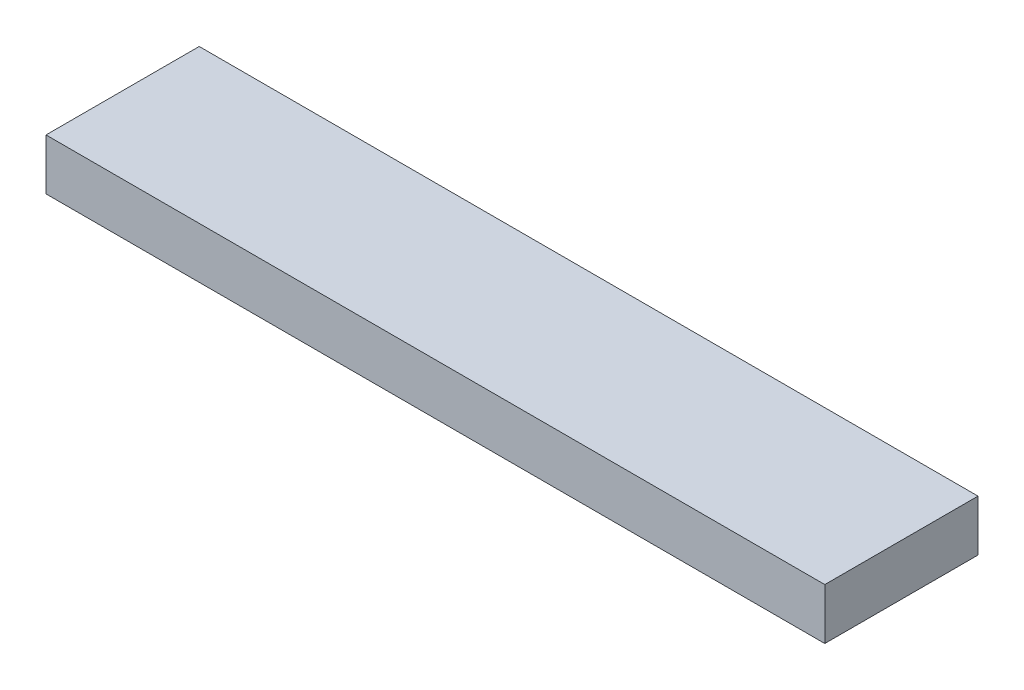
ISO-10303-21;
HEADER;
FILE_DESCRIPTION(('STEP AP214'),'2;1');
FILE_NAME('part.step','',(''),(''),'','','');
FILE_SCHEMA(('AUTOMOTIVE_DESIGN { 1 0 10303 214 1 1 1 1 }'));
ENDSEC;
DATA;
#1=APPLICATION_CONTEXT('core data for automotive mechanical design processes');
#2=APPLICATION_PROTOCOL_DEFINITION('international standard','automotive_design',2000,#1);
#3=PRODUCT_CONTEXT('',#1,'mechanical');
#4=PRODUCT('Part','Part','',(#3));
#5=PRODUCT_RELATED_PRODUCT_CATEGORY('part','',(#4));
#6=PRODUCT_DEFINITION_FORMATION('','',#4);
#7=PRODUCT_DEFINITION_CONTEXT('part definition',#1,'design');
#8=PRODUCT_DEFINITION('design','',#6,#7);
#9=PRODUCT_DEFINITION_SHAPE('','',#8);
#10=(LENGTH_UNIT() NAMED_UNIT(*) SI_UNIT(.MILLI.,.METRE.));
#11=(NAMED_UNIT(*) PLANE_ANGLE_UNIT() SI_UNIT($,.RADIAN.));
#12=(NAMED_UNIT(*) SI_UNIT($,.STERADIAN.) SOLID_ANGLE_UNIT());
#13=UNCERTAINTY_MEASURE_WITH_UNIT(LENGTH_MEASURE(1.E-05),#10,'distance_accuracy_value','');
#14=(GEOMETRIC_REPRESENTATION_CONTEXT(3) GLOBAL_UNCERTAINTY_ASSIGNED_CONTEXT((#13)) GLOBAL_UNIT_ASSIGNED_CONTEXT((#10,
#11,#12)) REPRESENTATION_CONTEXT('',''));
#15=CARTESIAN_POINT('',(0.,0.,0.));
#16=DIRECTION('',(0.,0.,1.));
#17=DIRECTION('',(1.,0.,0.));
#18=AXIS2_PLACEMENT_3D('',#15,#16,#17);
#19=CARTESIAN_POINT('',(96.8375,6.35,-19.05));
#20=DIRECTION('',(-1.,0.,0.));
#21=DIRECTION('',(0.,0.,1.));
#22=AXIS2_PLACEMENT_3D('',#19,#20,#21);
#23=PLANE('',#22);
#24=DIRECTION('',(0.,0.,-1.));
#25=VECTOR('',#24,1.);
#26=CARTESIAN_POINT('',(96.8375,-6.35,-19.05));
#27=LINE('',#26,#25);
#28=CARTESIAN_POINT('',(96.8375,-6.35,19.05));
#29=VERTEX_POINT('',#28);
#30=CARTESIAN_POINT('',(96.8375,-6.35,-19.05));
#31=VERTEX_POINT('',#30);
#32=EDGE_CURVE('E98',#29,#31,#27,.T.);
#33=ORIENTED_EDGE('',*,*,#32,.T.);
#34=DIRECTION('',(0.,-1.,0.));
#35=VECTOR('',#34,1.);
#36=CARTESIAN_POINT('',(96.8375,6.35,-19.05));
#37=LINE('',#36,#35);
#38=CARTESIAN_POINT('',(96.8375,6.35,-19.05));
#39=VERTEX_POINT('',#38);
#40=EDGE_CURVE('E11',#39,#31,#37,.T.);
#41=ORIENTED_EDGE('',*,*,#40,.F.);
#42=DIRECTION('',(0.,0.,-1.));
#43=VECTOR('',#42,1.);
#44=CARTESIAN_POINT('',(96.8375,6.35,-19.05));
#45=LINE('',#44,#43);
#46=CARTESIAN_POINT('',(96.8375,6.35,19.05));
#47=VERTEX_POINT('',#46);
#48=EDGE_CURVE('E86',#47,#39,#45,.T.);
#49=ORIENTED_EDGE('',*,*,#48,.F.);
#50=DIRECTION('',(0.,-1.,0.));
#51=VECTOR('',#50,1.);
#52=CARTESIAN_POINT('',(96.8375,6.35,19.05));
#53=LINE('',#52,#51);
#54=EDGE_CURVE('E94',#47,#29,#53,.T.);
#55=ORIENTED_EDGE('',*,*,#54,.T.);
#56=EDGE_LOOP('',(#33,#41,#49,#55));
#57=FACE_BOUND('',#56,.T.);
#58=ADVANCED_FACE('F35',(#57),#23,.F.);
#59=CARTESIAN_POINT('',(-96.8375,6.35,-19.05));
#60=DIRECTION('',(0.,0.,1.));
#61=DIRECTION('',(1.,0.,0.));
#62=AXIS2_PLACEMENT_3D('',#59,#60,#61);
#63=PLANE('',#62);
#64=DIRECTION('',(-1.,0.,0.));
#65=VECTOR('',#64,1.);
#66=CARTESIAN_POINT('',(-96.8375,-6.35,-19.05));
#67=LINE('',#66,#65);
#68=CARTESIAN_POINT('',(-96.8375,-6.35,-19.05));
#69=VERTEX_POINT('',#68);
#70=EDGE_CURVE('E90',#31,#69,#67,.T.);
#71=ORIENTED_EDGE('',*,*,#70,.T.);
#72=DIRECTION('',(0.,-1.,0.));
#73=VECTOR('',#72,1.);
#74=CARTESIAN_POINT('',(-96.8375,6.35,-19.05));
#75=LINE('',#74,#73);
#76=CARTESIAN_POINT('',(-96.8375,6.35,-19.05));
#77=VERTEX_POINT('',#76);
#78=EDGE_CURVE('E43',#77,#69,#75,.T.);
#79=ORIENTED_EDGE('',*,*,#78,.F.);
#80=DIRECTION('',(-1.,0.,0.));
#81=VECTOR('',#80,1.);
#82=CARTESIAN_POINT('',(-96.8375,6.35,-19.05));
#83=LINE('',#82,#81);
#84=EDGE_CURVE('E81',#39,#77,#83,.T.);
#85=ORIENTED_EDGE('',*,*,#84,.F.);
#86=ORIENTED_EDGE('',*,*,#40,.T.);
#87=EDGE_LOOP('',(#71,#79,#85,#86));
#88=FACE_BOUND('',#87,.T.);
#89=ADVANCED_FACE('F89',(#88),#63,.F.);
#90=CARTESIAN_POINT('',(-96.8375,6.35,-19.05));
#91=DIRECTION('',(1.,0.,0.));
#92=DIRECTION('',(0.,0.,-1.));
#93=AXIS2_PLACEMENT_3D('',#90,#91,#92);
#94=PLANE('',#93);
#95=DIRECTION('',(0.,0.,1.));
#96=VECTOR('',#95,1.);
#97=CARTESIAN_POINT('',(-96.8375,-6.35,-19.05));
#98=LINE('',#97,#96);
#99=CARTESIAN_POINT('',(-96.8375,-6.35,19.05));
#100=VERTEX_POINT('',#99);
#101=EDGE_CURVE('E68',#69,#100,#98,.T.);
#102=ORIENTED_EDGE('',*,*,#101,.T.);
#103=DIRECTION('',(0.,-1.,0.));
#104=VECTOR('',#103,1.);
#105=CARTESIAN_POINT('',(-96.8375,6.35,19.05));
#106=LINE('',#105,#104);
#107=CARTESIAN_POINT('',(-96.8375,6.35,19.05));
#108=VERTEX_POINT('',#107);
#109=EDGE_CURVE('E91',#108,#100,#106,.T.);
#110=ORIENTED_EDGE('',*,*,#109,.F.);
#111=DIRECTION('',(0.,0.,1.));
#112=VECTOR('',#111,1.);
#113=CARTESIAN_POINT('',(-96.8375,6.35,-19.05));
#114=LINE('',#113,#112);
#115=EDGE_CURVE('E84',#77,#108,#114,.T.);
#116=ORIENTED_EDGE('',*,*,#115,.F.);
#117=ORIENTED_EDGE('',*,*,#78,.T.);
#118=EDGE_LOOP('',(#102,#110,#116,#117));
#119=FACE_BOUND('',#118,.T.);
#120=ADVANCED_FACE('F92',(#119),#94,.F.);
#121=CARTESIAN_POINT('',(-96.8375,6.35,19.05));
#122=DIRECTION('',(0.,0.,-1.));
#123=DIRECTION('',(-1.,0.,0.));
#124=AXIS2_PLACEMENT_3D('',#121,#122,#123);
#125=PLANE('',#124);
#126=DIRECTION('',(1.,0.,0.));
#127=VECTOR('',#126,1.);
#128=CARTESIAN_POINT('',(-96.8375,-6.35,19.05));
#129=LINE('',#128,#127);
#130=EDGE_CURVE('E74',#100,#29,#129,.T.);
#131=ORIENTED_EDGE('',*,*,#130,.T.);
#132=ORIENTED_EDGE('',*,*,#54,.F.);
#133=DIRECTION('',(1.,0.,0.));
#134=VECTOR('',#133,1.);
#135=CARTESIAN_POINT('',(-96.8375,6.35,19.05));
#136=LINE('',#135,#134);
#137=EDGE_CURVE('E51',#108,#47,#136,.T.);
#138=ORIENTED_EDGE('',*,*,#137,.F.);
#139=ORIENTED_EDGE('',*,*,#109,.T.);
#140=EDGE_LOOP('',(#131,#132,#138,#139));
#141=FACE_BOUND('',#140,.T.);
#142=ADVANCED_FACE('F105',(#141),#125,.F.);
#143=CARTESIAN_POINT('',(0.,6.35,0.));
#144=DIRECTION('',(0.,1.,0.));
#145=DIRECTION('',(0.,0.,1.));
#146=AXIS2_PLACEMENT_3D('',#143,#144,#145);
#147=PLANE('',#146);
#148=ORIENTED_EDGE('',*,*,#48,.T.);
#149=ORIENTED_EDGE('',*,*,#84,.T.);
#150=ORIENTED_EDGE('',*,*,#115,.T.);
#151=ORIENTED_EDGE('',*,*,#137,.T.);
#152=EDGE_LOOP('',(#148,#149,#150,#151));
#153=FACE_BOUND('',#152,.T.);
#154=ADVANCED_FACE('F82',(#153),#147,.T.);
#155=CARTESIAN_POINT('',(0.,-6.35,0.));
#156=DIRECTION('',(0.,1.,0.));
#157=DIRECTION('',(0.,0.,1.));
#158=AXIS2_PLACEMENT_3D('',#155,#156,#157);
#159=PLANE('',#158);
#160=ORIENTED_EDGE('',*,*,#32,.F.);
#161=ORIENTED_EDGE('',*,*,#130,.F.);
#162=ORIENTED_EDGE('',*,*,#101,.F.);
#163=ORIENTED_EDGE('',*,*,#70,.F.);
#164=EDGE_LOOP('',(#160,#161,#162,#163));
#165=FACE_BOUND('',#164,.T.);
#166=ADVANCED_FACE('F108',(#165),#159,.F.);
#167=CLOSED_SHELL('',(#58,#89,#120,#142,#154,#166));
#168=MANIFOLD_SOLID_BREP('B2',#167);
#169=ADVANCED_BREP_SHAPE_REPRESENTATION('',(#18,#168),#14);
#170=SHAPE_DEFINITION_REPRESENTATION(#9,#169);
ENDSEC;
END-ISO-10303-21;
